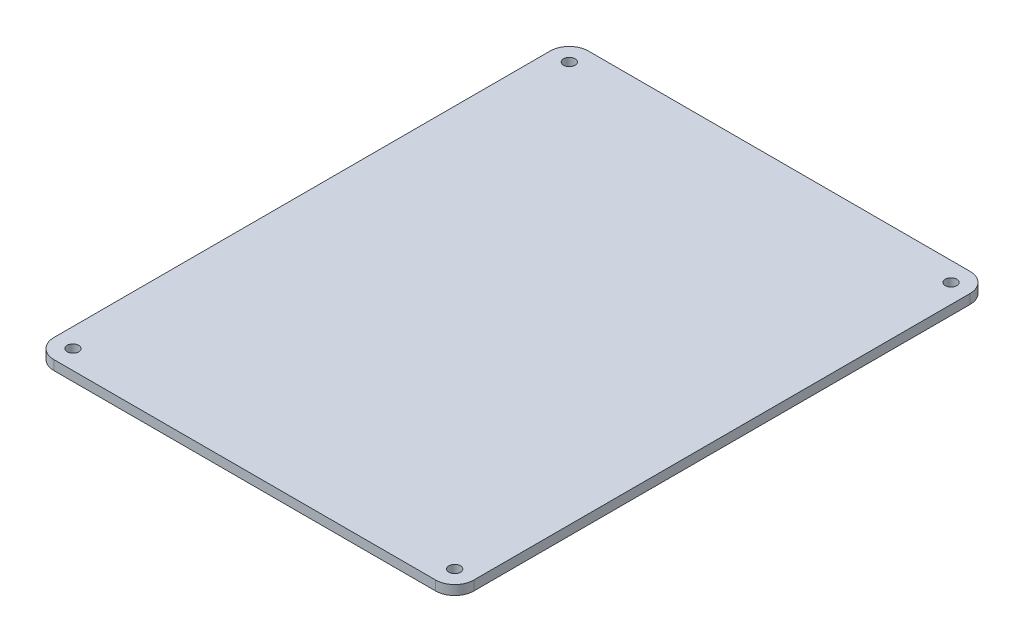
ISO-10303-21;
HEADER;
FILE_DESCRIPTION(('STEP AP214'),'2;1');
FILE_NAME('part.step','',(''),(''),'','','');
FILE_SCHEMA(('AUTOMOTIVE_DESIGN { 1 0 10303 214 1 1 1 1 }'));
ENDSEC;
DATA;
#1=APPLICATION_CONTEXT('core data for automotive mechanical design processes');
#2=APPLICATION_PROTOCOL_DEFINITION('international standard','automotive_design',2000,#1);
#3=PRODUCT_CONTEXT('',#1,'mechanical');
#4=PRODUCT('Part','Part','',(#3));
#5=PRODUCT_RELATED_PRODUCT_CATEGORY('part','',(#4));
#6=PRODUCT_DEFINITION_FORMATION('','',#4);
#7=PRODUCT_DEFINITION_CONTEXT('part definition',#1,'design');
#8=PRODUCT_DEFINITION('design','',#6,#7);
#9=PRODUCT_DEFINITION_SHAPE('','',#8);
#10=(LENGTH_UNIT() NAMED_UNIT(*) SI_UNIT(.MILLI.,.METRE.));
#11=(NAMED_UNIT(*) PLANE_ANGLE_UNIT() SI_UNIT($,.RADIAN.));
#12=(NAMED_UNIT(*) SI_UNIT($,.STERADIAN.) SOLID_ANGLE_UNIT());
#13=UNCERTAINTY_MEASURE_WITH_UNIT(LENGTH_MEASURE(1.E-05),#10,'distance_accuracy_value','');
#14=(GEOMETRIC_REPRESENTATION_CONTEXT(3) GLOBAL_UNCERTAINTY_ASSIGNED_CONTEXT((#13)) GLOBAL_UNIT_ASSIGNED_CONTEXT((#10,
#11,#12)) REPRESENTATION_CONTEXT('',''));
#15=CARTESIAN_POINT('',(0.,0.,0.));
#16=DIRECTION('',(0.,0.,1.));
#17=DIRECTION('',(1.,0.,0.));
#18=AXIS2_PLACEMENT_3D('',#15,#16,#17);
#19=CARTESIAN_POINT('',(-133.099479224988,179.637113730356,136.727321583706));
#20=DIRECTION('',(0.,-1.,0.));
#21=DIRECTION('',(0.,0.,-1.));
#22=AXIS2_PLACEMENT_3D('',#19,#20,#21);
#23=PLANE('',#22);
#24=CARTESIAN_POINT('',(-133.099479224988,179.637113730356,136.727321583706));
#25=DIRECTION('',(0.,1.,0.));
#26=DIRECTION('',(0.,0.,-1.));
#27=AXIS2_PLACEMENT_3D('',#24,#25,#26);
#28=CIRCLE('',#27,5.);
#29=CARTESIAN_POINT('',(-138.099479224988,179.637113730356,136.727321583706));
#30=VERTEX_POINT('',#29);
#31=CARTESIAN_POINT('',(-133.099479224988,179.637113730356,141.727321583706));
#32=VERTEX_POINT('',#31);
#33=EDGE_CURVE('E147',#30,#32,#28,.T.);
#34=ORIENTED_EDGE('',*,*,#33,.T.);
#35=DIRECTION('',(1.,0.,0.));
#36=VECTOR('',#35,1.);
#37=CARTESIAN_POINT('',(-133.099479224988,179.637113730356,141.727321583706));
#38=LINE('',#37,#36);
#39=CARTESIAN_POINT('',(-33.0994792249886,179.637113730356,141.727321583706));
#40=VERTEX_POINT('',#39);
#41=EDGE_CURVE('E95',#32,#40,#38,.T.);
#42=ORIENTED_EDGE('',*,*,#41,.T.);
#43=CARTESIAN_POINT('',(-33.0994792249885,179.637113730356,136.727321583706));
#44=DIRECTION('',(0.,1.,0.));
#45=DIRECTION('',(0.,0.,1.));
#46=AXIS2_PLACEMENT_3D('',#43,#44,#45);
#47=CIRCLE('',#46,5.);
#48=CARTESIAN_POINT('',(-28.0994792249885,179.637113730356,136.727321583706));
#49=VERTEX_POINT('',#48);
#50=EDGE_CURVE('E162',#40,#49,#47,.T.);
#51=ORIENTED_EDGE('',*,*,#50,.T.);
#52=DIRECTION('',(0.,0.,-1.));
#53=VECTOR('',#52,1.);
#54=CARTESIAN_POINT('',(-28.0994792249885,179.637113730356,6.72732158370606));
#55=LINE('',#54,#53);
#56=CARTESIAN_POINT('',(-28.0994792249885,179.637113730356,6.72732158370606));
#57=VERTEX_POINT('',#56);
#58=EDGE_CURVE('E175',#49,#57,#55,.T.);
#59=ORIENTED_EDGE('',*,*,#58,.T.);
#60=CARTESIAN_POINT('',(-33.0994792249885,179.637113730356,6.72732158370603));
#61=DIRECTION('',(0.,1.,0.));
#62=DIRECTION('',(0.,0.,1.));
#63=AXIS2_PLACEMENT_3D('',#60,#61,#62);
#64=CIRCLE('',#63,5.);
#65=CARTESIAN_POINT('',(-33.0994792249886,179.637113730356,1.72732158370603));
#66=VERTEX_POINT('',#65);
#67=EDGE_CURVE('E114',#57,#66,#64,.T.);
#68=ORIENTED_EDGE('',*,*,#67,.T.);
#69=DIRECTION('',(-1.,0.,0.));
#70=VECTOR('',#69,1.);
#71=CARTESIAN_POINT('',(-133.099479224988,179.637113730356,1.72732158370603));
#72=LINE('',#71,#70);
#73=CARTESIAN_POINT('',(-133.099479224988,179.637113730356,1.72732158370603));
#74=VERTEX_POINT('',#73);
#75=EDGE_CURVE('E108',#66,#74,#72,.T.);
#76=ORIENTED_EDGE('',*,*,#75,.T.);
#77=CARTESIAN_POINT('',(-133.099479224989,179.637113730356,6.72732158370603));
#78=DIRECTION('',(0.,1.,0.));
#79=DIRECTION('',(0.,0.,-1.));
#80=AXIS2_PLACEMENT_3D('',#77,#78,#79);
#81=CIRCLE('',#80,5.);
#82=CARTESIAN_POINT('',(-138.099479224989,179.637113730356,6.72732158370606));
#83=VERTEX_POINT('',#82);
#84=EDGE_CURVE('E112',#74,#83,#81,.T.);
#85=ORIENTED_EDGE('',*,*,#84,.T.);
#86=DIRECTION('',(0.,0.,1.));
#87=VECTOR('',#86,1.);
#88=CARTESIAN_POINT('',(-138.099479224989,179.637113730356,6.72732158370606));
#89=LINE('',#88,#87);
#90=EDGE_CURVE('E52',#83,#30,#89,.T.);
#91=ORIENTED_EDGE('',*,*,#90,.T.);
#92=EDGE_LOOP('',(#34,#42,#51,#59,#68,#76,#85,#91));
#93=FACE_BOUND('',#92,.T.);
#94=CARTESIAN_POINT('',(-133.099479224989,179.637113730356,6.72732158370603));
#95=DIRECTION('',(0.,1.,0.));
#96=DIRECTION('',(0.,0.,1.));
#97=AXIS2_PLACEMENT_3D('',#94,#95,#96);
#98=CIRCLE('',#97,1.5);
#99=CARTESIAN_POINT('',(-133.099479224989,179.637113730356,8.22732158370602));
#100=VERTEX_POINT('',#99);
#101=EDGE_CURVE('E136',#100,#100,#98,.T.);
#102=ORIENTED_EDGE('',*,*,#101,.F.);
#103=EDGE_LOOP('',(#102));
#104=FACE_BOUND('',#103,.T.);
#105=CARTESIAN_POINT('',(-33.0994792249885,179.637113730356,6.72732158370603));
#106=DIRECTION('',(0.,1.,0.));
#107=DIRECTION('',(0.,0.,1.));
#108=AXIS2_PLACEMENT_3D('',#105,#106,#107);
#109=CIRCLE('',#108,1.5);
#110=CARTESIAN_POINT('',(-33.0994792249885,179.637113730356,8.22732158370603));
#111=VERTEX_POINT('',#110);
#112=EDGE_CURVE('E184',#111,#111,#109,.T.);
#113=ORIENTED_EDGE('',*,*,#112,.F.);
#114=EDGE_LOOP('',(#113));
#115=FACE_BOUND('',#114,.T.);
#116=CARTESIAN_POINT('',(-33.0994792249885,179.637113730356,136.727321583706));
#117=DIRECTION('',(0.,1.,0.));
#118=DIRECTION('',(0.,0.,1.));
#119=AXIS2_PLACEMENT_3D('',#116,#117,#118);
#120=CIRCLE('',#119,1.5);
#121=CARTESIAN_POINT('',(-33.0994792249885,179.637113730356,138.227321583706));
#122=VERTEX_POINT('',#121);
#123=EDGE_CURVE('E190',#122,#122,#120,.T.);
#124=ORIENTED_EDGE('',*,*,#123,.F.);
#125=EDGE_LOOP('',(#124));
#126=FACE_BOUND('',#125,.T.);
#127=CARTESIAN_POINT('',(-133.099479224988,179.637113730356,136.727321583706));
#128=DIRECTION('',(0.,1.,0.));
#129=DIRECTION('',(0.,0.,1.));
#130=AXIS2_PLACEMENT_3D('',#127,#128,#129);
#131=CIRCLE('',#130,1.5);
#132=CARTESIAN_POINT('',(-133.099479224988,179.637113730356,138.227321583706));
#133=VERTEX_POINT('',#132);
#134=EDGE_CURVE('E196',#133,#133,#131,.T.);
#135=ORIENTED_EDGE('',*,*,#134,.F.);
#136=EDGE_LOOP('',(#135));
#137=FACE_BOUND('',#136,.T.);
#138=ADVANCED_FACE('F35',(#93,#104,#115,#126,#137),#23,.F.);
#139=CARTESIAN_POINT('',(-133.099479224988,177.137113730356,136.727321583706));
#140=DIRECTION('',(0.,-1.,0.));
#141=DIRECTION('',(0.,0.,-1.));
#142=AXIS2_PLACEMENT_3D('',#139,#140,#141);
#143=PLANE('',#142);
#144=CARTESIAN_POINT('',(-33.0994792249885,177.137113730356,136.727321583706));
#145=DIRECTION('',(0.,1.,0.));
#146=DIRECTION('',(0.,0.,1.));
#147=AXIS2_PLACEMENT_3D('',#144,#145,#146);
#148=CIRCLE('',#147,1.5);
#149=CARTESIAN_POINT('',(-33.0994792249885,177.137113730356,138.227321583706));
#150=VERTEX_POINT('',#149);
#151=EDGE_CURVE('E193',#150,#150,#148,.T.);
#152=ORIENTED_EDGE('',*,*,#151,.T.);
#153=EDGE_LOOP('',(#152));
#154=FACE_BOUND('',#153,.T.);
#155=CARTESIAN_POINT('',(-133.099479224989,177.137113730356,6.72732158370603));
#156=DIRECTION('',(0.,1.,0.));
#157=DIRECTION('',(0.,0.,1.));
#158=AXIS2_PLACEMENT_3D('',#155,#156,#157);
#159=CIRCLE('',#158,1.5);
#160=CARTESIAN_POINT('',(-133.099479224989,177.137113730356,8.22732158370602));
#161=VERTEX_POINT('',#160);
#162=EDGE_CURVE('E181',#161,#161,#159,.T.);
#163=ORIENTED_EDGE('',*,*,#162,.T.);
#164=EDGE_LOOP('',(#163));
#165=FACE_BOUND('',#164,.T.);
#166=CARTESIAN_POINT('',(-133.099479224988,177.137113730356,136.727321583706));
#167=DIRECTION('',(0.,1.,0.));
#168=DIRECTION('',(0.,0.,-1.));
#169=AXIS2_PLACEMENT_3D('',#166,#167,#168);
#170=CIRCLE('',#169,5.);
#171=CARTESIAN_POINT('',(-138.099479224988,177.137113730356,136.727321583706));
#172=VERTEX_POINT('',#171);
#173=CARTESIAN_POINT('',(-133.099479224988,177.137113730356,141.727321583706));
#174=VERTEX_POINT('',#173);
#175=EDGE_CURVE('E132',#172,#174,#170,.T.);
#176=ORIENTED_EDGE('',*,*,#175,.F.);
#177=DIRECTION('',(0.,0.,1.));
#178=VECTOR('',#177,1.);
#179=CARTESIAN_POINT('',(-138.099479224989,177.137113730356,6.72732158370606));
#180=LINE('',#179,#178);
#181=CARTESIAN_POINT('',(-138.099479224989,177.137113730356,6.72732158370606));
#182=VERTEX_POINT('',#181);
#183=EDGE_CURVE('E87',#182,#172,#180,.T.);
#184=ORIENTED_EDGE('',*,*,#183,.F.);
#185=CARTESIAN_POINT('',(-133.099479224989,177.137113730356,6.72732158370603));
#186=DIRECTION('',(0.,1.,0.));
#187=DIRECTION('',(0.,0.,-1.));
#188=AXIS2_PLACEMENT_3D('',#185,#186,#187);
#189=CIRCLE('',#188,5.);
#190=CARTESIAN_POINT('',(-133.099479224988,177.137113730356,1.72732158370603));
#191=VERTEX_POINT('',#190);
#192=EDGE_CURVE('E81',#191,#182,#189,.T.);
#193=ORIENTED_EDGE('',*,*,#192,.F.);
#194=DIRECTION('',(-1.,0.,0.));
#195=VECTOR('',#194,1.);
#196=CARTESIAN_POINT('',(-133.099479224988,177.137113730356,1.72732158370603));
#197=LINE('',#196,#195);
#198=CARTESIAN_POINT('',(-33.0994792249886,177.137113730356,1.72732158370603));
#199=VERTEX_POINT('',#198);
#200=EDGE_CURVE('E122',#199,#191,#197,.T.);
#201=ORIENTED_EDGE('',*,*,#200,.F.);
#202=CARTESIAN_POINT('',(-33.0994792249885,177.137113730356,6.72732158370603));
#203=DIRECTION('',(0.,1.,0.));
#204=DIRECTION('',(0.,0.,1.));
#205=AXIS2_PLACEMENT_3D('',#202,#203,#204);
#206=CIRCLE('',#205,5.);
#207=CARTESIAN_POINT('',(-28.0994792249885,177.137113730356,6.72732158370606));
#208=VERTEX_POINT('',#207);
#209=EDGE_CURVE('E142',#208,#199,#206,.T.);
#210=ORIENTED_EDGE('',*,*,#209,.F.);
#211=DIRECTION('',(0.,0.,-1.));
#212=VECTOR('',#211,1.);
#213=CARTESIAN_POINT('',(-28.0994792249885,177.137113730356,6.72732158370606));
#214=LINE('',#213,#212);
#215=CARTESIAN_POINT('',(-28.0994792249885,177.137113730356,136.727321583706));
#216=VERTEX_POINT('',#215);
#217=EDGE_CURVE('E140',#216,#208,#214,.T.);
#218=ORIENTED_EDGE('',*,*,#217,.F.);
#219=CARTESIAN_POINT('',(-33.0994792249885,177.137113730356,136.727321583706));
#220=DIRECTION('',(0.,1.,0.));
#221=DIRECTION('',(0.,0.,1.));
#222=AXIS2_PLACEMENT_3D('',#219,#220,#221);
#223=CIRCLE('',#222,5.);
#224=CARTESIAN_POINT('',(-33.0994792249886,177.137113730356,141.727321583706));
#225=VERTEX_POINT('',#224);
#226=EDGE_CURVE('E138',#225,#216,#223,.T.);
#227=ORIENTED_EDGE('',*,*,#226,.F.);
#228=DIRECTION('',(1.,0.,0.));
#229=VECTOR('',#228,1.);
#230=CARTESIAN_POINT('',(-133.099479224988,177.137113730356,141.727321583706));
#231=LINE('',#230,#229);
#232=EDGE_CURVE('E135',#174,#225,#231,.T.);
#233=ORIENTED_EDGE('',*,*,#232,.F.);
#234=EDGE_LOOP('',(#176,#184,#193,#201,#210,#218,#227,#233));
#235=FACE_BOUND('',#234,.T.);
#236=CARTESIAN_POINT('',(-33.0994792249885,177.137113730356,6.72732158370603));
#237=DIRECTION('',(0.,1.,0.));
#238=DIRECTION('',(0.,0.,1.));
#239=AXIS2_PLACEMENT_3D('',#236,#237,#238);
#240=CIRCLE('',#239,1.5);
#241=CARTESIAN_POINT('',(-33.0994792249885,177.137113730356,8.22732158370603));
#242=VERTEX_POINT('',#241);
#243=EDGE_CURVE('E187',#242,#242,#240,.T.);
#244=ORIENTED_EDGE('',*,*,#243,.T.);
#245=EDGE_LOOP('',(#244));
#246=FACE_BOUND('',#245,.T.);
#247=CARTESIAN_POINT('',(-133.099479224988,177.137113730356,136.727321583706));
#248=DIRECTION('',(0.,1.,0.));
#249=DIRECTION('',(0.,0.,1.));
#250=AXIS2_PLACEMENT_3D('',#247,#248,#249);
#251=CIRCLE('',#250,1.5);
#252=CARTESIAN_POINT('',(-133.099479224988,177.137113730356,138.227321583706));
#253=VERTEX_POINT('',#252);
#254=EDGE_CURVE('E199',#253,#253,#251,.T.);
#255=ORIENTED_EDGE('',*,*,#254,.T.);
#256=EDGE_LOOP('',(#255));
#257=FACE_BOUND('',#256,.T.);
#258=ADVANCED_FACE('F166',(#154,#165,#235,#246,#257),#143,.T.);
#259=CARTESIAN_POINT('',(-133.099479224988,179.637113730356,136.727321583706));
#260=DIRECTION('',(0.,-1.,0.));
#261=DIRECTION('',(0.,0.,-1.));
#262=AXIS2_PLACEMENT_3D('',#259,#260,#261);
#263=CYLINDRICAL_SURFACE('',#262,5.);
#264=ORIENTED_EDGE('',*,*,#175,.T.);
#265=DIRECTION('',(0.,-1.,0.));
#266=VECTOR('',#265,1.);
#267=CARTESIAN_POINT('',(-133.099479224988,179.637113730356,141.727321583706));
#268=LINE('',#267,#266);
#269=EDGE_CURVE('E11',#32,#174,#268,.T.);
#270=ORIENTED_EDGE('',*,*,#269,.F.);
#271=ORIENTED_EDGE('',*,*,#33,.F.);
#272=DIRECTION('',(0.,-1.,0.));
#273=VECTOR('',#272,1.);
#274=CARTESIAN_POINT('',(-138.099479224988,179.637113730356,136.727321583706));
#275=LINE('',#274,#273);
#276=EDGE_CURVE('E128',#30,#172,#275,.T.);
#277=ORIENTED_EDGE('',*,*,#276,.T.);
#278=EDGE_LOOP('',(#264,#270,#271,#277));
#279=FACE_BOUND('',#278,.T.);
#280=ADVANCED_FACE('F37',(#279),#263,.T.);
#281=CARTESIAN_POINT('',(-133.099479224988,179.637113730356,141.727321583706));
#282=DIRECTION('',(0.,0.,-1.));
#283=DIRECTION('',(-1.,0.,0.));
#284=AXIS2_PLACEMENT_3D('',#281,#282,#283);
#285=PLANE('',#284);
#286=ORIENTED_EDGE('',*,*,#232,.T.);
#287=DIRECTION('',(0.,-1.,0.));
#288=VECTOR('',#287,1.);
#289=CARTESIAN_POINT('',(-33.0994792249886,179.637113730356,141.727321583706));
#290=LINE('',#289,#288);
#291=EDGE_CURVE('E44',#40,#225,#290,.T.);
#292=ORIENTED_EDGE('',*,*,#291,.F.);
#293=ORIENTED_EDGE('',*,*,#41,.F.);
#294=ORIENTED_EDGE('',*,*,#269,.T.);
#295=EDGE_LOOP('',(#286,#292,#293,#294));
#296=FACE_BOUND('',#295,.T.);
#297=ADVANCED_FACE('F231',(#296),#285,.F.);
#298=CARTESIAN_POINT('',(-33.0994792249885,179.637113730356,136.727321583706));
#299=DIRECTION('',(0.,-1.,0.));
#300=DIRECTION('',(0.,0.,-1.));
#301=AXIS2_PLACEMENT_3D('',#298,#299,#300);
#302=CYLINDRICAL_SURFACE('',#301,5.);
#303=ORIENTED_EDGE('',*,*,#226,.T.);
#304=DIRECTION('',(0.,-1.,0.));
#305=VECTOR('',#304,1.);
#306=CARTESIAN_POINT('',(-28.0994792249885,179.637113730356,136.727321583706));
#307=LINE('',#306,#305);
#308=EDGE_CURVE('E154',#49,#216,#307,.T.);
#309=ORIENTED_EDGE('',*,*,#308,.F.);
#310=ORIENTED_EDGE('',*,*,#50,.F.);
#311=ORIENTED_EDGE('',*,*,#291,.T.);
#312=EDGE_LOOP('',(#303,#309,#310,#311));
#313=FACE_BOUND('',#312,.T.);
#314=ADVANCED_FACE('F160',(#313),#302,.T.);
#315=CARTESIAN_POINT('',(-28.0994792249885,179.637113730356,6.72732158370606));
#316=DIRECTION('',(-1.,0.,0.));
#317=DIRECTION('',(0.,0.,1.));
#318=AXIS2_PLACEMENT_3D('',#315,#316,#317);
#319=PLANE('',#318);
#320=ORIENTED_EDGE('',*,*,#217,.T.);
#321=DIRECTION('',(0.,-1.,0.));
#322=VECTOR('',#321,1.);
#323=CARTESIAN_POINT('',(-28.0994792249885,179.637113730356,6.72732158370606));
#324=LINE('',#323,#322);
#325=EDGE_CURVE('E151',#57,#208,#324,.T.);
#326=ORIENTED_EDGE('',*,*,#325,.F.);
#327=ORIENTED_EDGE('',*,*,#58,.F.);
#328=ORIENTED_EDGE('',*,*,#308,.T.);
#329=EDGE_LOOP('',(#320,#326,#327,#328));
#330=FACE_BOUND('',#329,.T.);
#331=ADVANCED_FACE('F171',(#330),#319,.F.);
#332=CARTESIAN_POINT('',(-33.0994792249885,179.637113730356,6.72732158370603));
#333=DIRECTION('',(0.,-1.,0.));
#334=DIRECTION('',(0.,0.,-1.));
#335=AXIS2_PLACEMENT_3D('',#332,#333,#334);
#336=CYLINDRICAL_SURFACE('',#335,5.);
#337=ORIENTED_EDGE('',*,*,#209,.T.);
#338=DIRECTION('',(0.,-1.,0.));
#339=VECTOR('',#338,1.);
#340=CARTESIAN_POINT('',(-33.0994792249886,179.637113730356,1.72732158370603));
#341=LINE('',#340,#339);
#342=EDGE_CURVE('E123',#66,#199,#341,.T.);
#343=ORIENTED_EDGE('',*,*,#342,.F.);
#344=ORIENTED_EDGE('',*,*,#67,.F.);
#345=ORIENTED_EDGE('',*,*,#325,.T.);
#346=EDGE_LOOP('',(#337,#343,#344,#345));
#347=FACE_BOUND('',#346,.T.);
#348=ADVANCED_FACE('F174',(#347),#336,.T.);
#349=CARTESIAN_POINT('',(-133.099479224988,179.637113730356,1.72732158370603));
#350=DIRECTION('',(0.,0.,1.));
#351=DIRECTION('',(1.,0.,0.));
#352=AXIS2_PLACEMENT_3D('',#349,#350,#351);
#353=PLANE('',#352);
#354=ORIENTED_EDGE('',*,*,#200,.T.);
#355=DIRECTION('',(0.,-1.,0.));
#356=VECTOR('',#355,1.);
#357=CARTESIAN_POINT('',(-133.099479224988,179.637113730356,1.72732158370603));
#358=LINE('',#357,#356);
#359=EDGE_CURVE('E119',#74,#191,#358,.T.);
#360=ORIENTED_EDGE('',*,*,#359,.F.);
#361=ORIENTED_EDGE('',*,*,#75,.F.);
#362=ORIENTED_EDGE('',*,*,#342,.T.);
#363=EDGE_LOOP('',(#354,#360,#361,#362));
#364=FACE_BOUND('',#363,.T.);
#365=ADVANCED_FACE('F120',(#364),#353,.F.);
#366=CARTESIAN_POINT('',(-133.099479224989,179.637113730356,6.72732158370603));
#367=DIRECTION('',(0.,-1.,0.));
#368=DIRECTION('',(0.,0.,-1.));
#369=AXIS2_PLACEMENT_3D('',#366,#367,#368);
#370=CYLINDRICAL_SURFACE('',#369,5.);
#371=ORIENTED_EDGE('',*,*,#192,.T.);
#372=DIRECTION('',(0.,-1.,0.));
#373=VECTOR('',#372,1.);
#374=CARTESIAN_POINT('',(-138.099479224989,179.637113730356,6.72732158370606));
#375=LINE('',#374,#373);
#376=EDGE_CURVE('E124',#83,#182,#375,.T.);
#377=ORIENTED_EDGE('',*,*,#376,.F.);
#378=ORIENTED_EDGE('',*,*,#84,.F.);
#379=ORIENTED_EDGE('',*,*,#359,.T.);
#380=EDGE_LOOP('',(#371,#377,#378,#379));
#381=FACE_BOUND('',#380,.T.);
#382=ADVANCED_FACE('F126',(#381),#370,.T.);
#383=CARTESIAN_POINT('',(-138.099479224989,179.637113730356,6.72732158370606));
#384=DIRECTION('',(1.,0.,0.));
#385=DIRECTION('',(0.,0.,-1.));
#386=AXIS2_PLACEMENT_3D('',#383,#384,#385);
#387=PLANE('',#386);
#388=ORIENTED_EDGE('',*,*,#183,.T.);
#389=ORIENTED_EDGE('',*,*,#276,.F.);
#390=ORIENTED_EDGE('',*,*,#90,.F.);
#391=ORIENTED_EDGE('',*,*,#376,.T.);
#392=EDGE_LOOP('',(#388,#389,#390,#391));
#393=FACE_BOUND('',#392,.T.);
#394=ADVANCED_FACE('F219',(#393),#387,.F.);
#395=CARTESIAN_POINT('',(-133.099479224989,179.637113730356,6.72732158370603));
#396=DIRECTION('',(0.,-1.,0.));
#397=DIRECTION('',(0.,0.,-1.));
#398=AXIS2_PLACEMENT_3D('',#395,#396,#397);
#399=CYLINDRICAL_SURFACE('',#398,1.5);
#400=ORIENTED_EDGE('',*,*,#101,.T.);
#401=EDGE_LOOP('',(#400));
#402=FACE_BOUND('',#401,.T.);
#403=ORIENTED_EDGE('',*,*,#162,.F.);
#404=EDGE_LOOP('',(#403));
#405=FACE_BOUND('',#404,.T.);
#406=ADVANCED_FACE('F216',(#402,#405),#399,.F.);
#407=CARTESIAN_POINT('',(-33.0994792249885,179.637113730356,6.72732158370603));
#408=DIRECTION('',(0.,-1.,0.));
#409=DIRECTION('',(0.,0.,-1.));
#410=AXIS2_PLACEMENT_3D('',#407,#408,#409);
#411=CYLINDRICAL_SURFACE('',#410,1.5);
#412=ORIENTED_EDGE('',*,*,#112,.T.);
#413=EDGE_LOOP('',(#412));
#414=FACE_BOUND('',#413,.T.);
#415=ORIENTED_EDGE('',*,*,#243,.F.);
#416=EDGE_LOOP('',(#415));
#417=FACE_BOUND('',#416,.T.);
#418=ADVANCED_FACE('F309',(#414,#417),#411,.F.);
#419=CARTESIAN_POINT('',(-33.0994792249885,179.637113730356,136.727321583706));
#420=DIRECTION('',(0.,-1.,0.));
#421=DIRECTION('',(0.,0.,-1.));
#422=AXIS2_PLACEMENT_3D('',#419,#420,#421);
#423=CYLINDRICAL_SURFACE('',#422,1.5);
#424=ORIENTED_EDGE('',*,*,#123,.T.);
#425=EDGE_LOOP('',(#424));
#426=FACE_BOUND('',#425,.T.);
#427=ORIENTED_EDGE('',*,*,#151,.F.);
#428=EDGE_LOOP('',(#427));
#429=FACE_BOUND('',#428,.T.);
#430=ADVANCED_FACE('F317',(#426,#429),#423,.F.);
#431=CARTESIAN_POINT('',(-133.099479224988,179.637113730356,136.727321583706));
#432=DIRECTION('',(0.,-1.,0.));
#433=DIRECTION('',(0.,0.,-1.));
#434=AXIS2_PLACEMENT_3D('',#431,#432,#433);
#435=CYLINDRICAL_SURFACE('',#434,1.5);
#436=ORIENTED_EDGE('',*,*,#134,.T.);
#437=EDGE_LOOP('',(#436));
#438=FACE_BOUND('',#437,.T.);
#439=ORIENTED_EDGE('',*,*,#254,.F.);
#440=EDGE_LOOP('',(#439));
#441=FACE_BOUND('',#440,.T.);
#442=ADVANCED_FACE('F205',(#438,#441),#435,.F.);
#443=CLOSED_SHELL('',(#138,#258,#280,#297,#314,#331,#348,#365,#382,#394,#406,#418,#430,#442));
#444=MANIFOLD_SOLID_BREP('B2',#443);
#445=ADVANCED_BREP_SHAPE_REPRESENTATION('',(#18,#444),#14);
#446=SHAPE_DEFINITION_REPRESENTATION(#9,#445);
ENDSEC;
END-ISO-10303-21;
